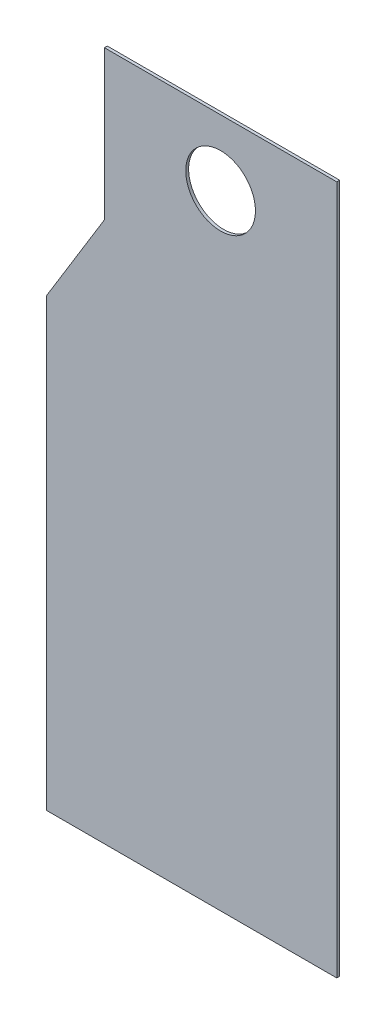
ISO-10303-21;
HEADER;
FILE_DESCRIPTION(('STEP AP214'),'2;1');
FILE_NAME('part.step','',(''),(''),'','','');
FILE_SCHEMA(('AUTOMOTIVE_DESIGN { 1 0 10303 214 1 1 1 1 }'));
ENDSEC;
DATA;
#1=APPLICATION_CONTEXT('core data for automotive mechanical design processes');
#2=APPLICATION_PROTOCOL_DEFINITION('international standard','automotive_design',2000,#1);
#3=PRODUCT_CONTEXT('',#1,'mechanical');
#4=PRODUCT('Part','Part','',(#3));
#5=PRODUCT_RELATED_PRODUCT_CATEGORY('part','',(#4));
#6=PRODUCT_DEFINITION_FORMATION('','',#4);
#7=PRODUCT_DEFINITION_CONTEXT('part definition',#1,'design');
#8=PRODUCT_DEFINITION('design','',#6,#7);
#9=PRODUCT_DEFINITION_SHAPE('','',#8);
#10=(LENGTH_UNIT() NAMED_UNIT(*) SI_UNIT(.MILLI.,.METRE.));
#11=(NAMED_UNIT(*) PLANE_ANGLE_UNIT() SI_UNIT($,.RADIAN.));
#12=(NAMED_UNIT(*) SI_UNIT($,.STERADIAN.) SOLID_ANGLE_UNIT());
#13=UNCERTAINTY_MEASURE_WITH_UNIT(LENGTH_MEASURE(1.E-05),#10,'distance_accuracy_value','');
#14=(GEOMETRIC_REPRESENTATION_CONTEXT(3) GLOBAL_UNCERTAINTY_ASSIGNED_CONTEXT((#13)) GLOBAL_UNIT_ASSIGNED_CONTEXT((#10,
#11,#12)) REPRESENTATION_CONTEXT('',''));
#15=CARTESIAN_POINT('',(0.,0.,0.));
#16=DIRECTION('',(0.,0.,1.));
#17=DIRECTION('',(1.,0.,0.));
#18=AXIS2_PLACEMENT_3D('',#15,#16,#17);
#19=CARTESIAN_POINT('',(0.,0.,3.));
#20=DIRECTION('',(0.,0.,-1.));
#21=DIRECTION('',(-1.,0.,0.));
#22=AXIS2_PLACEMENT_3D('',#19,#20,#21);
#23=PLANE('',#22);
#24=DIRECTION('',(-0.52215385963853,-0.852851304076266,0.));
#25=VECTOR('',#24,1.);
#26=CARTESIAN_POINT('',(-59.9999999999999,-97.9999999999999,3.));
#27=LINE('',#26,#25);
#28=CARTESIAN_POINT('',(0.,0.,3.));
#29=VERTEX_POINT('',#28);
#30=CARTESIAN_POINT('',(-59.9999999999999,-97.9999999999999,3.));
#31=VERTEX_POINT('',#30);
#32=EDGE_CURVE('E133',#29,#31,#27,.T.);
#33=ORIENTED_EDGE('',*,*,#32,.T.);
#34=DIRECTION('',(0.,-1.,0.));
#35=VECTOR('',#34,1.);
#36=CARTESIAN_POINT('',(-59.9999999999999,-558.,3.));
#37=LINE('',#36,#35);
#38=CARTESIAN_POINT('',(-59.9999999999999,-558.,3.));
#39=VERTEX_POINT('',#38);
#40=EDGE_CURVE('E91',#31,#39,#37,.T.);
#41=ORIENTED_EDGE('',*,*,#40,.T.);
#42=DIRECTION('',(1.,0.,0.));
#43=VECTOR('',#42,1.);
#44=CARTESIAN_POINT('',(240.,-558.,3.));
#45=LINE('',#44,#43);
#46=CARTESIAN_POINT('',(240.,-558.,3.));
#47=VERTEX_POINT('',#46);
#48=EDGE_CURVE('E104',#39,#47,#45,.T.);
#49=ORIENTED_EDGE('',*,*,#48,.T.);
#50=DIRECTION('',(0.,1.,0.));
#51=VECTOR('',#50,1.);
#52=CARTESIAN_POINT('',(240.,154.,3.));
#53=LINE('',#52,#51);
#54=CARTESIAN_POINT('',(240.,154.,3.));
#55=VERTEX_POINT('',#54);
#56=EDGE_CURVE('E98',#47,#55,#53,.T.);
#57=ORIENTED_EDGE('',*,*,#56,.T.);
#58=DIRECTION('',(-1.,0.,0.));
#59=VECTOR('',#58,1.);
#60=CARTESIAN_POINT('',(0.,154.,3.));
#61=LINE('',#60,#59);
#62=CARTESIAN_POINT('',(0.,154.,3.));
#63=VERTEX_POINT('',#62);
#64=EDGE_CURVE('E102',#55,#63,#61,.T.);
#65=ORIENTED_EDGE('',*,*,#64,.T.);
#66=DIRECTION('',(0.,-1.,0.));
#67=VECTOR('',#66,1.);
#68=CARTESIAN_POINT('',(0.,0.,3.));
#69=LINE('',#68,#67);
#70=EDGE_CURVE('E54',#63,#29,#69,.T.);
#71=ORIENTED_EDGE('',*,*,#70,.T.);
#72=EDGE_LOOP('',(#33,#41,#49,#57,#65,#71));
#73=FACE_BOUND('',#72,.T.);
#74=CARTESIAN_POINT('',(120.,86.,3.));
#75=DIRECTION('',(0.,0.,1.));
#76=DIRECTION('',(1.,0.,0.));
#77=AXIS2_PLACEMENT_3D('',#74,#75,#76);
#78=CIRCLE('',#77,36.);
#79=CARTESIAN_POINT('',(156.,86.,3.));
#80=VERTEX_POINT('',#79);
#81=EDGE_CURVE('E126',#80,#80,#78,.T.);
#82=ORIENTED_EDGE('',*,*,#81,.F.);
#83=EDGE_LOOP('',(#82));
#84=FACE_BOUND('',#83,.T.);
#85=ADVANCED_FACE('F37',(#73,#84),#23,.F.);
#86=CARTESIAN_POINT('',(0.,0.,0.));
#87=DIRECTION('',(0.,0.,-1.));
#88=DIRECTION('',(-1.,0.,0.));
#89=AXIS2_PLACEMENT_3D('',#86,#87,#88);
#90=PLANE('',#89);
#91=DIRECTION('',(-0.52215385963853,-0.852851304076266,0.));
#92=VECTOR('',#91,1.);
#93=CARTESIAN_POINT('',(-59.9999999999999,-97.9999999999999,0.));
#94=LINE('',#93,#92);
#95=CARTESIAN_POINT('',(0.,0.,0.));
#96=VERTEX_POINT('',#95);
#97=CARTESIAN_POINT('',(-59.9999999999999,-97.9999999999999,0.));
#98=VERTEX_POINT('',#97);
#99=EDGE_CURVE('E122',#96,#98,#94,.T.);
#100=ORIENTED_EDGE('',*,*,#99,.F.);
#101=DIRECTION('',(0.,-1.,0.));
#102=VECTOR('',#101,1.);
#103=CARTESIAN_POINT('',(0.,0.,0.));
#104=LINE('',#103,#102);
#105=CARTESIAN_POINT('',(0.,154.,0.));
#106=VERTEX_POINT('',#105);
#107=EDGE_CURVE('E83',#106,#96,#104,.T.);
#108=ORIENTED_EDGE('',*,*,#107,.F.);
#109=DIRECTION('',(-1.,0.,0.));
#110=VECTOR('',#109,1.);
#111=CARTESIAN_POINT('',(0.,154.,0.));
#112=LINE('',#111,#110);
#113=CARTESIAN_POINT('',(240.,154.,0.));
#114=VERTEX_POINT('',#113);
#115=EDGE_CURVE('E77',#114,#106,#112,.T.);
#116=ORIENTED_EDGE('',*,*,#115,.F.);
#117=DIRECTION('',(0.,1.,0.));
#118=VECTOR('',#117,1.);
#119=CARTESIAN_POINT('',(240.,154.,0.));
#120=LINE('',#119,#118);
#121=CARTESIAN_POINT('',(240.,-558.,0.));
#122=VERTEX_POINT('',#121);
#123=EDGE_CURVE('E112',#122,#114,#120,.T.);
#124=ORIENTED_EDGE('',*,*,#123,.F.);
#125=DIRECTION('',(1.,0.,0.));
#126=VECTOR('',#125,1.);
#127=CARTESIAN_POINT('',(240.,-558.,0.));
#128=LINE('',#127,#126);
#129=CARTESIAN_POINT('',(-59.9999999999999,-558.,0.));
#130=VERTEX_POINT('',#129);
#131=EDGE_CURVE('E128',#130,#122,#128,.T.);
#132=ORIENTED_EDGE('',*,*,#131,.F.);
#133=DIRECTION('',(0.,-1.,0.));
#134=VECTOR('',#133,1.);
#135=CARTESIAN_POINT('',(-59.9999999999999,-558.,0.));
#136=LINE('',#135,#134);
#137=EDGE_CURVE('E125',#98,#130,#136,.T.);
#138=ORIENTED_EDGE('',*,*,#137,.F.);
#139=EDGE_LOOP('',(#100,#108,#116,#124,#132,#138));
#140=FACE_BOUND('',#139,.T.);
#141=CARTESIAN_POINT('',(120.,86.,0.));
#142=DIRECTION('',(0.,0.,1.));
#143=DIRECTION('',(1.,0.,0.));
#144=AXIS2_PLACEMENT_3D('',#141,#142,#143);
#145=CIRCLE('',#144,36.);
#146=CARTESIAN_POINT('',(156.,86.,0.));
#147=VERTEX_POINT('',#146);
#148=EDGE_CURVE('E244',#147,#147,#145,.T.);
#149=ORIENTED_EDGE('',*,*,#148,.T.);
#150=EDGE_LOOP('',(#149));
#151=FACE_BOUND('',#150,.T.);
#152=ADVANCED_FACE('F142',(#140,#151),#90,.T.);
#153=CARTESIAN_POINT('',(-59.9999999999999,-97.9999999999999,3.));
#154=DIRECTION('',(0.852851304076265,-0.52215385963853,0.));
#155=DIRECTION('',(0.52215385963853,0.852851304076265,0.));
#156=AXIS2_PLACEMENT_3D('',#153,#154,#155);
#157=PLANE('',#156);
#158=ORIENTED_EDGE('',*,*,#99,.T.);
#159=DIRECTION('',(0.,0.,-1.));
#160=VECTOR('',#159,1.);
#161=CARTESIAN_POINT('',(-59.9999999999999,-97.9999999999999,3.));
#162=LINE('',#161,#160);
#163=EDGE_CURVE('E11',#31,#98,#162,.T.);
#164=ORIENTED_EDGE('',*,*,#163,.F.);
#165=ORIENTED_EDGE('',*,*,#32,.F.);
#166=DIRECTION('',(0.,0.,-1.));
#167=VECTOR('',#166,1.);
#168=CARTESIAN_POINT('',(0.,0.,3.));
#169=LINE('',#168,#167);
#170=EDGE_CURVE('E118',#29,#96,#169,.T.);
#171=ORIENTED_EDGE('',*,*,#170,.T.);
#172=EDGE_LOOP('',(#158,#164,#165,#171));
#173=FACE_BOUND('',#172,.T.);
#174=ADVANCED_FACE('F39',(#173),#157,.F.);
#175=CARTESIAN_POINT('',(-59.9999999999999,-558.,3.));
#176=DIRECTION('',(1.,0.,0.));
#177=DIRECTION('',(0.,0.,-1.));
#178=AXIS2_PLACEMENT_3D('',#175,#176,#177);
#179=PLANE('',#178);
#180=ORIENTED_EDGE('',*,*,#137,.T.);
#181=DIRECTION('',(0.,0.,-1.));
#182=VECTOR('',#181,1.);
#183=CARTESIAN_POINT('',(-59.9999999999999,-558.,3.));
#184=LINE('',#183,#182);
#185=EDGE_CURVE('E46',#39,#130,#184,.T.);
#186=ORIENTED_EDGE('',*,*,#185,.F.);
#187=ORIENTED_EDGE('',*,*,#40,.F.);
#188=ORIENTED_EDGE('',*,*,#163,.T.);
#189=EDGE_LOOP('',(#180,#186,#187,#188));
#190=FACE_BOUND('',#189,.T.);
#191=ADVANCED_FACE('F167',(#190),#179,.F.);
#192=CARTESIAN_POINT('',(240.,-558.,3.));
#193=DIRECTION('',(0.,1.,0.));
#194=DIRECTION('',(0.,0.,1.));
#195=AXIS2_PLACEMENT_3D('',#192,#193,#194);
#196=PLANE('',#195);
#197=ORIENTED_EDGE('',*,*,#131,.T.);
#198=DIRECTION('',(0.,0.,-1.));
#199=VECTOR('',#198,1.);
#200=CARTESIAN_POINT('',(240.,-558.,3.));
#201=LINE('',#200,#199);
#202=EDGE_CURVE('E113',#47,#122,#201,.T.);
#203=ORIENTED_EDGE('',*,*,#202,.F.);
#204=ORIENTED_EDGE('',*,*,#48,.F.);
#205=ORIENTED_EDGE('',*,*,#185,.T.);
#206=EDGE_LOOP('',(#197,#203,#204,#205));
#207=FACE_BOUND('',#206,.T.);
#208=ADVANCED_FACE('F139',(#207),#196,.F.);
#209=CARTESIAN_POINT('',(240.,154.,3.));
#210=DIRECTION('',(-1.,0.,0.));
#211=DIRECTION('',(0.,-1.,0.));
#212=AXIS2_PLACEMENT_3D('',#209,#210,#211);
#213=PLANE('',#212);
#214=ORIENTED_EDGE('',*,*,#123,.T.);
#215=DIRECTION('',(0.,0.,-1.));
#216=VECTOR('',#215,1.);
#217=CARTESIAN_POINT('',(240.,154.,3.));
#218=LINE('',#217,#216);
#219=EDGE_CURVE('E109',#55,#114,#218,.T.);
#220=ORIENTED_EDGE('',*,*,#219,.F.);
#221=ORIENTED_EDGE('',*,*,#56,.F.);
#222=ORIENTED_EDGE('',*,*,#202,.T.);
#223=EDGE_LOOP('',(#214,#220,#221,#222));
#224=FACE_BOUND('',#223,.T.);
#225=ADVANCED_FACE('F110',(#224),#213,.F.);
#226=CARTESIAN_POINT('',(0.,154.,3.));
#227=DIRECTION('',(0.,-1.,0.));
#228=DIRECTION('',(0.,0.,-1.));
#229=AXIS2_PLACEMENT_3D('',#226,#227,#228);
#230=PLANE('',#229);
#231=ORIENTED_EDGE('',*,*,#115,.T.);
#232=DIRECTION('',(0.,0.,-1.));
#233=VECTOR('',#232,1.);
#234=CARTESIAN_POINT('',(0.,154.,3.));
#235=LINE('',#234,#233);
#236=EDGE_CURVE('E114',#63,#106,#235,.T.);
#237=ORIENTED_EDGE('',*,*,#236,.F.);
#238=ORIENTED_EDGE('',*,*,#64,.F.);
#239=ORIENTED_EDGE('',*,*,#219,.T.);
#240=EDGE_LOOP('',(#231,#237,#238,#239));
#241=FACE_BOUND('',#240,.T.);
#242=ADVANCED_FACE('F116',(#241),#230,.F.);
#243=CARTESIAN_POINT('',(0.,0.,3.));
#244=DIRECTION('',(1.,0.,0.));
#245=DIRECTION('',(0.,0.,-1.));
#246=AXIS2_PLACEMENT_3D('',#243,#244,#245);
#247=PLANE('',#246);
#248=ORIENTED_EDGE('',*,*,#107,.T.);
#249=ORIENTED_EDGE('',*,*,#170,.F.);
#250=ORIENTED_EDGE('',*,*,#70,.F.);
#251=ORIENTED_EDGE('',*,*,#236,.T.);
#252=EDGE_LOOP('',(#248,#249,#250,#251));
#253=FACE_BOUND('',#252,.T.);
#254=ADVANCED_FACE('F147',(#253),#247,.F.);
#255=CARTESIAN_POINT('',(120.,86.,3.));
#256=DIRECTION('',(0.,0.,-1.));
#257=DIRECTION('',(-1.,0.,0.));
#258=AXIS2_PLACEMENT_3D('',#255,#256,#257);
#259=CYLINDRICAL_SURFACE('',#258,36.);
#260=ORIENTED_EDGE('',*,*,#81,.T.);
#261=EDGE_LOOP('',(#260));
#262=FACE_BOUND('',#261,.T.);
#263=ORIENTED_EDGE('',*,*,#148,.F.);
#264=EDGE_LOOP('',(#263));
#265=FACE_BOUND('',#264,.T.);
#266=ADVANCED_FACE('F149',(#262,#265),#259,.F.);
#267=CLOSED_SHELL('',(#85,#152,#174,#191,#208,#225,#242,#254,#266));
#268=MANIFOLD_SOLID_BREP('B2',#267);
#269=ADVANCED_BREP_SHAPE_REPRESENTATION('',(#18,#268),#14);
#270=SHAPE_DEFINITION_REPRESENTATION(#9,#269);
ENDSEC;
END-ISO-10303-21;
